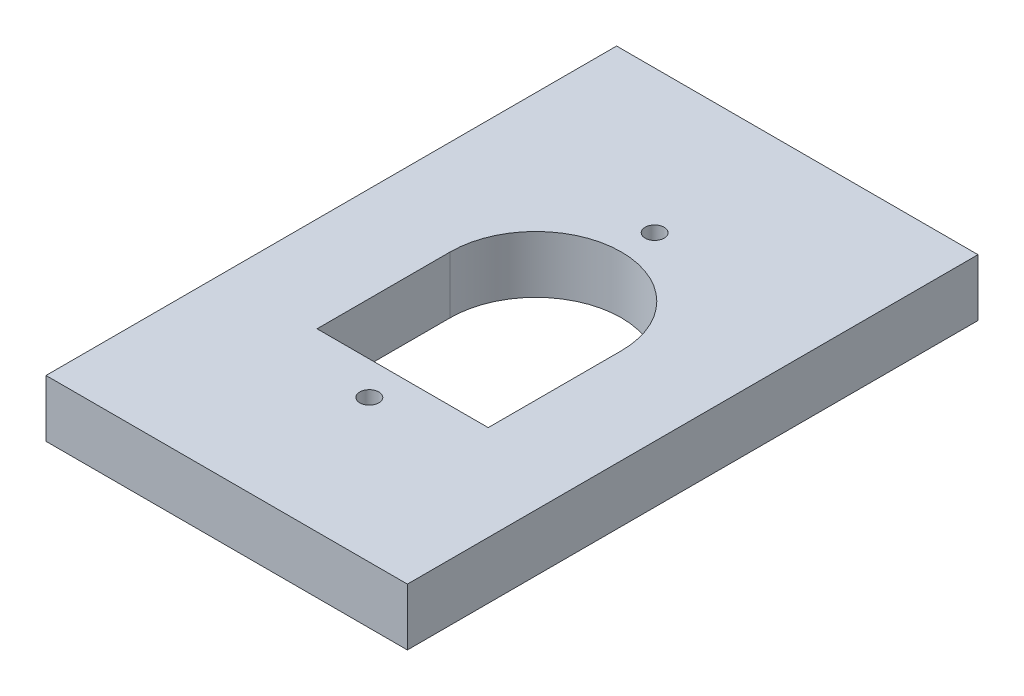
ISO-10303-21;
HEADER;
FILE_DESCRIPTION(('STEP AP214'),'2;1');
FILE_NAME('part.step','',(''),(''),'','','');
FILE_SCHEMA(('AUTOMOTIVE_DESIGN { 1 0 10303 214 1 1 1 1 }'));
ENDSEC;
DATA;
#1=APPLICATION_CONTEXT('core data for automotive mechanical design processes');
#2=APPLICATION_PROTOCOL_DEFINITION('international standard','automotive_design',2000,#1);
#3=PRODUCT_CONTEXT('',#1,'mechanical');
#4=PRODUCT('Part','Part','',(#3));
#5=PRODUCT_RELATED_PRODUCT_CATEGORY('part','',(#4));
#6=PRODUCT_DEFINITION_FORMATION('','',#4);
#7=PRODUCT_DEFINITION_CONTEXT('part definition',#1,'design');
#8=PRODUCT_DEFINITION('design','',#6,#7);
#9=PRODUCT_DEFINITION_SHAPE('','',#8);
#10=(LENGTH_UNIT() NAMED_UNIT(*) SI_UNIT(.MILLI.,.METRE.));
#11=(NAMED_UNIT(*) PLANE_ANGLE_UNIT() SI_UNIT($,.RADIAN.));
#12=(NAMED_UNIT(*) SI_UNIT($,.STERADIAN.) SOLID_ANGLE_UNIT());
#13=UNCERTAINTY_MEASURE_WITH_UNIT(LENGTH_MEASURE(1.E-05),#10,'distance_accuracy_value','');
#14=(GEOMETRIC_REPRESENTATION_CONTEXT(3) GLOBAL_UNCERTAINTY_ASSIGNED_CONTEXT((#13)) GLOBAL_UNIT_ASSIGNED_CONTEXT((#10,
#11,#12)) REPRESENTATION_CONTEXT('',''));
#15=CARTESIAN_POINT('',(0.,0.,0.));
#16=DIRECTION('',(0.,0.,1.));
#17=DIRECTION('',(1.,0.,0.));
#18=AXIS2_PLACEMENT_3D('',#15,#16,#17);
#19=CARTESIAN_POINT('',(0.,3.,0.));
#20=DIRECTION('',(1.,0.,0.));
#21=DIRECTION('',(0.,0.,-1.));
#22=AXIS2_PLACEMENT_3D('',#19,#20,#21);
#23=PLANE('',#22);
#24=DIRECTION('',(0.,0.,1.));
#25=VECTOR('',#24,1.);
#26=CARTESIAN_POINT('',(0.,0.,0.));
#27=LINE('',#26,#25);
#28=CARTESIAN_POINT('',(0.,0.,0.));
#29=VERTEX_POINT('',#28);
#30=CARTESIAN_POINT('',(0.,0.,30.));
#31=VERTEX_POINT('',#30);
#32=EDGE_CURVE('E132',#29,#31,#27,.T.);
#33=ORIENTED_EDGE('',*,*,#32,.T.);
#34=DIRECTION('',(0.,-1.,0.));
#35=VECTOR('',#34,1.);
#36=CARTESIAN_POINT('',(0.,3.,30.));
#37=LINE('',#36,#35);
#38=CARTESIAN_POINT('',(0.,3.,30.));
#39=VERTEX_POINT('',#38);
#40=EDGE_CURVE('E11',#39,#31,#37,.T.);
#41=ORIENTED_EDGE('',*,*,#40,.F.);
#42=DIRECTION('',(0.,0.,1.));
#43=VECTOR('',#42,1.);
#44=CARTESIAN_POINT('',(0.,3.,0.));
#45=LINE('',#44,#43);
#46=CARTESIAN_POINT('',(0.,3.,0.));
#47=VERTEX_POINT('',#46);
#48=EDGE_CURVE('E136',#47,#39,#45,.T.);
#49=ORIENTED_EDGE('',*,*,#48,.F.);
#50=DIRECTION('',(0.,-1.,0.));
#51=VECTOR('',#50,1.);
#52=CARTESIAN_POINT('',(0.,3.,0.));
#53=LINE('',#52,#51);
#54=EDGE_CURVE('E146',#47,#29,#53,.T.);
#55=ORIENTED_EDGE('',*,*,#54,.T.);
#56=EDGE_LOOP('',(#33,#41,#49,#55));
#57=FACE_BOUND('',#56,.T.);
#58=ADVANCED_FACE('F33',(#57),#23,.F.);
#59=CARTESIAN_POINT('',(0.,3.,30.));
#60=DIRECTION('',(0.,0.,-1.));
#61=DIRECTION('',(-1.,0.,0.));
#62=AXIS2_PLACEMENT_3D('',#59,#60,#61);
#63=PLANE('',#62);
#64=DIRECTION('',(1.,0.,0.));
#65=VECTOR('',#64,1.);
#66=CARTESIAN_POINT('',(0.,0.,30.));
#67=LINE('',#66,#65);
#68=CARTESIAN_POINT('',(19.,0.,30.));
#69=VERTEX_POINT('',#68);
#70=EDGE_CURVE('E149',#31,#69,#67,.T.);
#71=ORIENTED_EDGE('',*,*,#70,.T.);
#72=DIRECTION('',(0.,-1.,0.));
#73=VECTOR('',#72,1.);
#74=CARTESIAN_POINT('',(19.,3.,30.));
#75=LINE('',#74,#73);
#76=CARTESIAN_POINT('',(19.,3.,30.));
#77=VERTEX_POINT('',#76);
#78=EDGE_CURVE('E40',#77,#69,#75,.T.);
#79=ORIENTED_EDGE('',*,*,#78,.F.);
#80=DIRECTION('',(1.,0.,0.));
#81=VECTOR('',#80,1.);
#82=CARTESIAN_POINT('',(0.,3.,30.));
#83=LINE('',#82,#81);
#84=EDGE_CURVE('E139',#39,#77,#83,.T.);
#85=ORIENTED_EDGE('',*,*,#84,.F.);
#86=ORIENTED_EDGE('',*,*,#40,.T.);
#87=EDGE_LOOP('',(#71,#79,#85,#86));
#88=FACE_BOUND('',#87,.T.);
#89=ADVANCED_FACE('F177',(#88),#63,.F.);
#90=CARTESIAN_POINT('',(19.,3.,0.));
#91=DIRECTION('',(-1.,0.,0.));
#92=DIRECTION('',(0.,0.,1.));
#93=AXIS2_PLACEMENT_3D('',#90,#91,#92);
#94=PLANE('',#93);
#95=DIRECTION('',(0.,0.,-1.));
#96=VECTOR('',#95,1.);
#97=CARTESIAN_POINT('',(19.,0.,0.));
#98=LINE('',#97,#96);
#99=CARTESIAN_POINT('',(19.,0.,0.));
#100=VERTEX_POINT('',#99);
#101=EDGE_CURVE('E151',#69,#100,#98,.T.);
#102=ORIENTED_EDGE('',*,*,#101,.T.);
#103=DIRECTION('',(0.,-1.,0.));
#104=VECTOR('',#103,1.);
#105=CARTESIAN_POINT('',(19.,3.,0.));
#106=LINE('',#105,#104);
#107=CARTESIAN_POINT('',(19.,3.,0.));
#108=VERTEX_POINT('',#107);
#109=EDGE_CURVE('E156',#108,#100,#106,.T.);
#110=ORIENTED_EDGE('',*,*,#109,.F.);
#111=DIRECTION('',(0.,0.,-1.));
#112=VECTOR('',#111,1.);
#113=CARTESIAN_POINT('',(19.,3.,0.));
#114=LINE('',#113,#112);
#115=EDGE_CURVE('E142',#77,#108,#114,.T.);
#116=ORIENTED_EDGE('',*,*,#115,.F.);
#117=ORIENTED_EDGE('',*,*,#78,.T.);
#118=EDGE_LOOP('',(#102,#110,#116,#117));
#119=FACE_BOUND('',#118,.T.);
#120=ADVANCED_FACE('F163',(#119),#94,.F.);
#121=CARTESIAN_POINT('',(0.,3.,0.));
#122=DIRECTION('',(0.,0.,1.));
#123=DIRECTION('',(1.,0.,0.));
#124=AXIS2_PLACEMENT_3D('',#121,#122,#123);
#125=PLANE('',#124);
#126=DIRECTION('',(-1.,0.,0.));
#127=VECTOR('',#126,1.);
#128=CARTESIAN_POINT('',(0.,0.,0.));
#129=LINE('',#128,#127);
#130=EDGE_CURVE('E140',#100,#29,#129,.T.);
#131=ORIENTED_EDGE('',*,*,#130,.T.);
#132=ORIENTED_EDGE('',*,*,#54,.F.);
#133=DIRECTION('',(-1.,0.,0.));
#134=VECTOR('',#133,1.);
#135=CARTESIAN_POINT('',(0.,3.,0.));
#136=LINE('',#135,#134);
#137=EDGE_CURVE('E144',#108,#47,#136,.T.);
#138=ORIENTED_EDGE('',*,*,#137,.F.);
#139=ORIENTED_EDGE('',*,*,#109,.T.);
#140=EDGE_LOOP('',(#131,#132,#138,#139));
#141=FACE_BOUND('',#140,.T.);
#142=ADVANCED_FACE('F170',(#141),#125,.F.);
#143=CARTESIAN_POINT('',(0.,3.,0.));
#144=DIRECTION('',(0.,1.,0.));
#145=DIRECTION('',(0.,0.,1.));
#146=AXIS2_PLACEMENT_3D('',#143,#144,#145);
#147=PLANE('',#146);
#148=CARTESIAN_POINT('',(9.49999999999993,3.,7.50000000000003));
#149=DIRECTION('',(0.,1.,0.));
#150=DIRECTION('',(0.,0.,1.));
#151=AXIS2_PLACEMENT_3D('',#148,#149,#150);
#152=CIRCLE('',#151,0.499999999999999);
#153=CARTESIAN_POINT('',(9.49999999999993,3.,8.00000000000003));
#154=VERTEX_POINT('',#153);
#155=EDGE_CURVE('E119',#154,#154,#152,.T.);
#156=ORIENTED_EDGE('',*,*,#155,.F.);
#157=EDGE_LOOP('',(#156));
#158=FACE_BOUND('',#157,.T.);
#159=CARTESIAN_POINT('',(9.50000000000001,3.,22.5));
#160=DIRECTION('',(0.,1.,0.));
#161=DIRECTION('',(0.,0.,1.));
#162=AXIS2_PLACEMENT_3D('',#159,#160,#161);
#163=CIRCLE('',#162,0.5);
#164=CARTESIAN_POINT('',(9.50000000000001,3.,23.));
#165=VERTEX_POINT('',#164);
#166=EDGE_CURVE('E219',#165,#165,#163,.T.);
#167=ORIENTED_EDGE('',*,*,#166,.F.);
#168=EDGE_LOOP('',(#167));
#169=FACE_BOUND('',#168,.T.);
#170=DIRECTION('',(0.,0.,-1.));
#171=VECTOR('',#170,1.);
#172=CARTESIAN_POINT('',(13.9999999999999,3.,0.));
#173=LINE('',#172,#171);
#174=CARTESIAN_POINT('',(14.,3.,20.75));
#175=VERTEX_POINT('',#174);
#176=CARTESIAN_POINT('',(14.,3.,13.75));
#177=VERTEX_POINT('',#176);
#178=EDGE_CURVE('E47',#175,#177,#173,.T.);
#179=ORIENTED_EDGE('',*,*,#178,.F.);
#180=DIRECTION('',(-1.,0.,0.));
#181=VECTOR('',#180,1.);
#182=CARTESIAN_POINT('',(1.03987035032166E-13,3.,20.7500000000001));
#183=LINE('',#182,#181);
#184=CARTESIAN_POINT('',(5.,3.,20.75));
#185=VERTEX_POINT('',#184);
#186=EDGE_CURVE('E113',#175,#185,#183,.T.);
#187=ORIENTED_EDGE('',*,*,#186,.T.);
#188=DIRECTION('',(0.,0.,-1.));
#189=VECTOR('',#188,1.);
#190=CARTESIAN_POINT('',(4.9999999999999,3.,0.));
#191=LINE('',#190,#189);
#192=CARTESIAN_POINT('',(4.99999999999996,3.,13.75));
#193=VERTEX_POINT('',#192);
#194=EDGE_CURVE('E116',#185,#193,#191,.T.);
#195=ORIENTED_EDGE('',*,*,#194,.T.);
#196=CARTESIAN_POINT('',(9.49999999999996,3.,13.75));
#197=DIRECTION('',(0.,1.,0.));
#198=DIRECTION('',(0.,0.,1.));
#199=AXIS2_PLACEMENT_3D('',#196,#197,#198);
#200=CIRCLE('',#199,4.5);
#201=EDGE_CURVE('E125',#177,#193,#200,.T.);
#202=ORIENTED_EDGE('',*,*,#201,.F.);
#203=EDGE_LOOP('',(#179,#187,#195,#202));
#204=FACE_BOUND('',#203,.T.);
#205=ORIENTED_EDGE('',*,*,#48,.T.);
#206=ORIENTED_EDGE('',*,*,#84,.T.);
#207=ORIENTED_EDGE('',*,*,#115,.T.);
#208=ORIENTED_EDGE('',*,*,#137,.T.);
#209=EDGE_LOOP('',(#205,#206,#207,#208));
#210=FACE_BOUND('',#209,.T.);
#211=ADVANCED_FACE('F176',(#158,#169,#204,#210),#147,.T.);
#212=CARTESIAN_POINT('',(0.,0.,0.));
#213=DIRECTION('',(0.,1.,0.));
#214=DIRECTION('',(0.,0.,1.));
#215=AXIS2_PLACEMENT_3D('',#212,#213,#214);
#216=PLANE('',#215);
#217=CARTESIAN_POINT('',(9.49999999999993,0.,7.50000000000003));
#218=DIRECTION('',(0.,1.,0.));
#219=DIRECTION('',(0.,0.,1.));
#220=AXIS2_PLACEMENT_3D('',#217,#218,#219);
#221=CIRCLE('',#220,0.499999999999999);
#222=CARTESIAN_POINT('',(9.49999999999993,0.,8.00000000000003));
#223=VERTEX_POINT('',#222);
#224=EDGE_CURVE('E221',#223,#223,#221,.T.);
#225=ORIENTED_EDGE('',*,*,#224,.T.);
#226=EDGE_LOOP('',(#225));
#227=FACE_BOUND('',#226,.T.);
#228=CARTESIAN_POINT('',(9.50000000000001,0.,22.5));
#229=DIRECTION('',(0.,1.,0.));
#230=DIRECTION('',(0.,0.,1.));
#231=AXIS2_PLACEMENT_3D('',#228,#229,#230);
#232=CIRCLE('',#231,0.5);
#233=CARTESIAN_POINT('',(9.50000000000001,0.,23.));
#234=VERTEX_POINT('',#233);
#235=EDGE_CURVE('E126',#234,#234,#232,.T.);
#236=ORIENTED_EDGE('',*,*,#235,.T.);
#237=EDGE_LOOP('',(#236));
#238=FACE_BOUND('',#237,.T.);
#239=DIRECTION('',(-1.,0.,0.));
#240=VECTOR('',#239,1.);
#241=CARTESIAN_POINT('',(1.03987035032166E-13,0.,20.7500000000001));
#242=LINE('',#241,#240);
#243=CARTESIAN_POINT('',(14.,0.,20.75));
#244=VERTEX_POINT('',#243);
#245=CARTESIAN_POINT('',(5.,0.,20.75));
#246=VERTEX_POINT('',#245);
#247=EDGE_CURVE('E102',#244,#246,#242,.T.);
#248=ORIENTED_EDGE('',*,*,#247,.F.);
#249=DIRECTION('',(0.,0.,-1.));
#250=VECTOR('',#249,1.);
#251=CARTESIAN_POINT('',(13.9999999999999,0.,0.));
#252=LINE('',#251,#250);
#253=CARTESIAN_POINT('',(14.,0.,13.75));
#254=VERTEX_POINT('',#253);
#255=EDGE_CURVE('E99',#244,#254,#252,.T.);
#256=ORIENTED_EDGE('',*,*,#255,.T.);
#257=CARTESIAN_POINT('',(9.49999999999996,0.,13.75));
#258=DIRECTION('',(0.,1.,0.));
#259=DIRECTION('',(0.,0.,1.));
#260=AXIS2_PLACEMENT_3D('',#257,#258,#259);
#261=CIRCLE('',#260,4.5);
#262=CARTESIAN_POINT('',(4.99999999999996,0.,13.75));
#263=VERTEX_POINT('',#262);
#264=EDGE_CURVE('E105',#254,#263,#261,.T.);
#265=ORIENTED_EDGE('',*,*,#264,.T.);
#266=DIRECTION('',(0.,0.,-1.));
#267=VECTOR('',#266,1.);
#268=CARTESIAN_POINT('',(4.9999999999999,0.,0.));
#269=LINE('',#268,#267);
#270=EDGE_CURVE('E109',#246,#263,#269,.T.);
#271=ORIENTED_EDGE('',*,*,#270,.F.);
#272=EDGE_LOOP('',(#248,#256,#265,#271));
#273=FACE_BOUND('',#272,.T.);
#274=ORIENTED_EDGE('',*,*,#32,.F.);
#275=ORIENTED_EDGE('',*,*,#130,.F.);
#276=ORIENTED_EDGE('',*,*,#101,.F.);
#277=ORIENTED_EDGE('',*,*,#70,.F.);
#278=EDGE_LOOP('',(#274,#275,#276,#277));
#279=FACE_BOUND('',#278,.T.);
#280=ADVANCED_FACE('F111',(#227,#238,#273,#279),#216,.F.);
#281=CARTESIAN_POINT('',(13.9999999999999,0.,0.));
#282=DIRECTION('',(1.,0.,0.));
#283=DIRECTION('',(0.,0.,-1.));
#284=AXIS2_PLACEMENT_3D('',#281,#282,#283);
#285=PLANE('',#284);
#286=ORIENTED_EDGE('',*,*,#178,.T.);
#287=DIRECTION('',(0.,1.,0.));
#288=VECTOR('',#287,1.);
#289=CARTESIAN_POINT('',(14.,0.,13.75));
#290=LINE('',#289,#288);
#291=EDGE_CURVE('E96',#254,#177,#290,.T.);
#292=ORIENTED_EDGE('',*,*,#291,.F.);
#293=ORIENTED_EDGE('',*,*,#255,.F.);
#294=DIRECTION('',(0.,1.,0.));
#295=VECTOR('',#294,1.);
#296=CARTESIAN_POINT('',(14.,0.,20.75));
#297=LINE('',#296,#295);
#298=EDGE_CURVE('E130',#244,#175,#297,.T.);
#299=ORIENTED_EDGE('',*,*,#298,.T.);
#300=EDGE_LOOP('',(#286,#292,#293,#299));
#301=FACE_BOUND('',#300,.T.);
#302=ADVANCED_FACE('F97',(#301),#285,.F.);
#303=CARTESIAN_POINT('',(1.03987035032166E-13,0.,20.7500000000001));
#304=DIRECTION('',(0.,0.,-1.));
#305=DIRECTION('',(-1.,0.,0.));
#306=AXIS2_PLACEMENT_3D('',#303,#304,#305);
#307=PLANE('',#306);
#308=ORIENTED_EDGE('',*,*,#186,.F.);
#309=ORIENTED_EDGE('',*,*,#298,.F.);
#310=ORIENTED_EDGE('',*,*,#247,.T.);
#311=DIRECTION('',(0.,1.,0.));
#312=VECTOR('',#311,1.);
#313=CARTESIAN_POINT('',(5.,0.,20.75));
#314=LINE('',#313,#312);
#315=EDGE_CURVE('E133',#246,#185,#314,.T.);
#316=ORIENTED_EDGE('',*,*,#315,.T.);
#317=EDGE_LOOP('',(#308,#309,#310,#316));
#318=FACE_BOUND('',#317,.T.);
#319=ADVANCED_FACE('F195',(#318),#307,.T.);
#320=CARTESIAN_POINT('',(4.9999999999999,0.,0.));
#321=DIRECTION('',(1.,0.,0.));
#322=DIRECTION('',(0.,0.,-1.));
#323=AXIS2_PLACEMENT_3D('',#320,#321,#322);
#324=PLANE('',#323);
#325=ORIENTED_EDGE('',*,*,#194,.F.);
#326=ORIENTED_EDGE('',*,*,#315,.F.);
#327=ORIENTED_EDGE('',*,*,#270,.T.);
#328=DIRECTION('',(0.,1.,0.));
#329=VECTOR('',#328,1.);
#330=CARTESIAN_POINT('',(4.99999999999996,0.,13.75));
#331=LINE('',#330,#329);
#332=EDGE_CURVE('E55',#263,#193,#331,.T.);
#333=ORIENTED_EDGE('',*,*,#332,.T.);
#334=EDGE_LOOP('',(#325,#326,#327,#333));
#335=FACE_BOUND('',#334,.T.);
#336=ADVANCED_FACE('F199',(#335),#324,.T.);
#337=CARTESIAN_POINT('',(9.49999999999996,0.,13.75));
#338=DIRECTION('',(0.,1.,0.));
#339=DIRECTION('',(0.,0.,1.));
#340=AXIS2_PLACEMENT_3D('',#337,#338,#339);
#341=CYLINDRICAL_SURFACE('',#340,4.5);
#342=ORIENTED_EDGE('',*,*,#201,.T.);
#343=ORIENTED_EDGE('',*,*,#332,.F.);
#344=ORIENTED_EDGE('',*,*,#264,.F.);
#345=ORIENTED_EDGE('',*,*,#291,.T.);
#346=EDGE_LOOP('',(#342,#343,#344,#345));
#347=FACE_BOUND('',#346,.T.);
#348=ADVANCED_FACE('F106',(#347),#341,.F.);
#349=CARTESIAN_POINT('',(9.50000000000001,0.,22.5));
#350=DIRECTION('',(0.,1.,0.));
#351=DIRECTION('',(0.,0.,1.));
#352=AXIS2_PLACEMENT_3D('',#349,#350,#351);
#353=CYLINDRICAL_SURFACE('',#352,0.5);
#354=ORIENTED_EDGE('',*,*,#235,.F.);
#355=EDGE_LOOP('',(#354));
#356=FACE_BOUND('',#355,.T.);
#357=ORIENTED_EDGE('',*,*,#166,.T.);
#358=EDGE_LOOP('',(#357));
#359=FACE_BOUND('',#358,.T.);
#360=ADVANCED_FACE('F198',(#356,#359),#353,.F.);
#361=CARTESIAN_POINT('',(9.49999999999993,0.,7.50000000000003));
#362=DIRECTION('',(0.,1.,0.));
#363=DIRECTION('',(0.,0.,1.));
#364=AXIS2_PLACEMENT_3D('',#361,#362,#363);
#365=CYLINDRICAL_SURFACE('',#364,0.499999999999999);
#366=ORIENTED_EDGE('',*,*,#224,.F.);
#367=EDGE_LOOP('',(#366));
#368=FACE_BOUND('',#367,.T.);
#369=ORIENTED_EDGE('',*,*,#155,.T.);
#370=EDGE_LOOP('',(#369));
#371=FACE_BOUND('',#370,.T.);
#372=ADVANCED_FACE('F206',(#368,#371),#365,.F.);
#373=CLOSED_SHELL('',(#58,#89,#120,#142,#211,#280,#302,#319,#336,#348,#360,#372));
#374=MANIFOLD_SOLID_BREP('B2',#373);
#375=ADVANCED_BREP_SHAPE_REPRESENTATION('',(#18,#374),#14);
#376=SHAPE_DEFINITION_REPRESENTATION(#9,#375);
ENDSEC;
END-ISO-10303-21;
